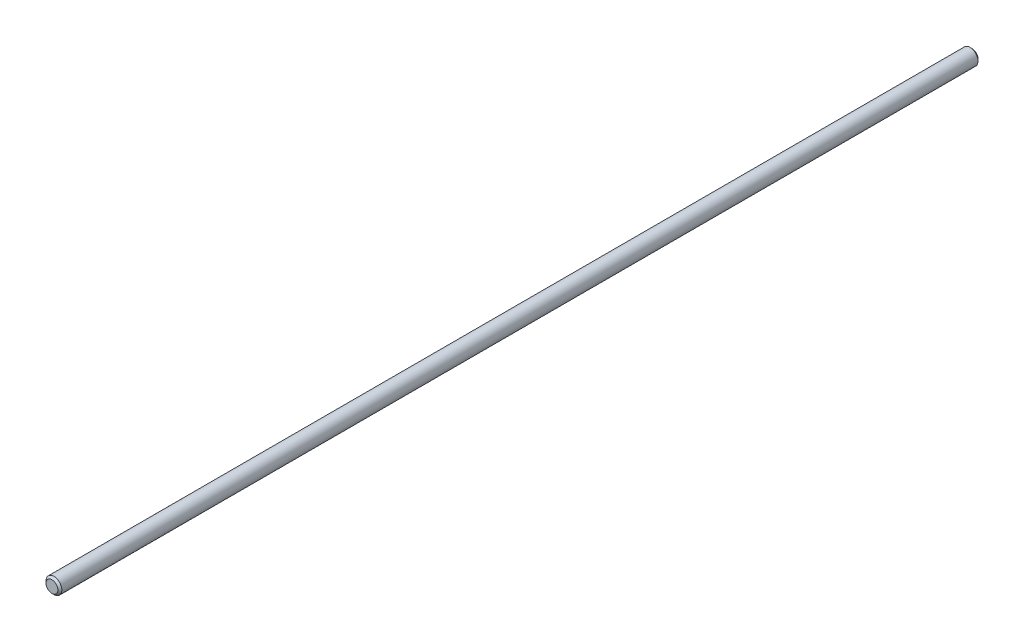
ISO-10303-21;
HEADER;
FILE_DESCRIPTION(('STEP AP214'),'2;1');
FILE_NAME('part.step','',(''),(''),'','','');
FILE_SCHEMA(('AUTOMOTIVE_DESIGN { 1 0 10303 214 1 1 1 1 }'));
ENDSEC;
DATA;
#1=APPLICATION_CONTEXT('core data for automotive mechanical design processes');
#2=APPLICATION_PROTOCOL_DEFINITION('international standard','automotive_design',2000,#1);
#3=PRODUCT_CONTEXT('',#1,'mechanical');
#4=PRODUCT('Part','Part','',(#3));
#5=PRODUCT_RELATED_PRODUCT_CATEGORY('part','',(#4));
#6=PRODUCT_DEFINITION_FORMATION('','',#4);
#7=PRODUCT_DEFINITION_CONTEXT('part definition',#1,'design');
#8=PRODUCT_DEFINITION('design','',#6,#7);
#9=PRODUCT_DEFINITION_SHAPE('','',#8);
#10=(LENGTH_UNIT() NAMED_UNIT(*) SI_UNIT(.MILLI.,.METRE.));
#11=(NAMED_UNIT(*) PLANE_ANGLE_UNIT() SI_UNIT($,.RADIAN.));
#12=(NAMED_UNIT(*) SI_UNIT($,.STERADIAN.) SOLID_ANGLE_UNIT());
#13=UNCERTAINTY_MEASURE_WITH_UNIT(LENGTH_MEASURE(1.E-05),#10,'distance_accuracy_value','');
#14=(GEOMETRIC_REPRESENTATION_CONTEXT(3) GLOBAL_UNCERTAINTY_ASSIGNED_CONTEXT((#13)) GLOBAL_UNIT_ASSIGNED_CONTEXT((#10,
#11,#12)) REPRESENTATION_CONTEXT('',''));
#15=CARTESIAN_POINT('',(0.,0.,0.));
#16=DIRECTION('',(0.,0.,1.));
#17=DIRECTION('',(1.,0.,0.));
#18=AXIS2_PLACEMENT_3D('',#15,#16,#17);
#19=CARTESIAN_POINT('',(0.,0.,465.));
#20=DIRECTION('',(0.,0.,-1.));
#21=DIRECTION('',(-1.,0.,0.));
#22=AXIS2_PLACEMENT_3D('',#19,#20,#21);
#23=CYLINDRICAL_SURFACE('',#22,4.);
#24=CARTESIAN_POINT('',(0.,0.,1.00000000000011));
#25=DIRECTION('',(0.,0.,1.));
#26=DIRECTION('',(1.,0.,0.));
#27=AXIS2_PLACEMENT_3D('',#24,#25,#26);
#28=CIRCLE('',#27,4.);
#29=CARTESIAN_POINT('',(4.,0.,1.00000000000011));
#30=VERTEX_POINT('',#29);
#31=EDGE_CURVE('E46',#30,#30,#28,.T.);
#32=ORIENTED_EDGE('',*,*,#31,.T.);
#33=EDGE_LOOP('',(#32));
#34=FACE_BOUND('',#33,.T.);
#35=CARTESIAN_POINT('',(0.,0.,464.));
#36=DIRECTION('',(0.,0.,1.));
#37=DIRECTION('',(1.,0.,0.));
#38=AXIS2_PLACEMENT_3D('',#35,#36,#37);
#39=CIRCLE('',#38,4.);
#40=CARTESIAN_POINT('',(4.,0.,464.));
#41=VERTEX_POINT('',#40);
#42=EDGE_CURVE('E50',#41,#41,#39,.F.);
#43=ORIENTED_EDGE('',*,*,#42,.T.);
#44=EDGE_LOOP('',(#43));
#45=FACE_BOUND('',#44,.T.);
#46=ADVANCED_FACE('F35',(#34,#45),#23,.T.);
#47=CARTESIAN_POINT('',(0.,0.,465.));
#48=DIRECTION('',(0.,0.,1.));
#49=DIRECTION('',(1.,0.,0.));
#50=AXIS2_PLACEMENT_3D('',#47,#48,#49);
#51=PLANE('',#50);
#52=CARTESIAN_POINT('',(0.,0.,465.));
#53=DIRECTION('',(0.,0.,1.));
#54=DIRECTION('',(1.,0.,0.));
#55=AXIS2_PLACEMENT_3D('',#52,#53,#54);
#56=CIRCLE('',#55,2.99999999999995);
#57=CARTESIAN_POINT('',(2.99999999999995,0.,465.));
#58=VERTEX_POINT('',#57);
#59=EDGE_CURVE('E10',#58,#58,#56,.T.);
#60=ORIENTED_EDGE('',*,*,#59,.T.);
#61=EDGE_LOOP('',(#60));
#62=FACE_BOUND('',#61,.T.);
#63=ADVANCED_FACE('F66',(#62),#51,.T.);
#64=CARTESIAN_POINT('',(0.,0.,0.));
#65=DIRECTION('',(0.,0.,1.));
#66=DIRECTION('',(1.,0.,0.));
#67=AXIS2_PLACEMENT_3D('',#64,#65,#66);
#68=PLANE('',#67);
#69=CARTESIAN_POINT('',(0.,0.,0.));
#70=DIRECTION('',(0.,0.,1.));
#71=DIRECTION('',(1.,0.,0.));
#72=AXIS2_PLACEMENT_3D('',#69,#70,#71);
#73=CIRCLE('',#72,2.99999999999995);
#74=CARTESIAN_POINT('',(2.99999999999995,0.,0.));
#75=VERTEX_POINT('',#74);
#76=EDGE_CURVE('E42',#75,#75,#73,.F.);
#77=ORIENTED_EDGE('',*,*,#76,.T.);
#78=EDGE_LOOP('',(#77));
#79=FACE_BOUND('',#78,.T.);
#80=ADVANCED_FACE('F63',(#79),#68,.F.);
#81=CARTESIAN_POINT('',(0.,0.,1.00000000000011));
#82=DIRECTION('',(0.,0.,1.));
#83=DIRECTION('',(1.,0.,0.));
#84=AXIS2_PLACEMENT_3D('',#81,#82,#83);
#85=CONICAL_SURFACE('',#84,4.,0.785398163397419);
#86=ORIENTED_EDGE('',*,*,#76,.F.);
#87=EDGE_LOOP('',(#86));
#88=FACE_BOUND('',#87,.T.);
#89=ORIENTED_EDGE('',*,*,#31,.F.);
#90=EDGE_LOOP('',(#89));
#91=FACE_BOUND('',#90,.T.);
#92=ADVANCED_FACE('F59',(#88,#91),#85,.T.);
#93=CARTESIAN_POINT('',(0.,0.,465.));
#94=DIRECTION('',(0.,0.,-1.));
#95=DIRECTION('',(-1.,0.,0.));
#96=AXIS2_PLACEMENT_3D('',#93,#94,#95);
#97=CONICAL_SURFACE('',#96,2.99999999999995,0.785398163397447);
#98=ORIENTED_EDGE('',*,*,#42,.F.);
#99=EDGE_LOOP('',(#98));
#100=FACE_BOUND('',#99,.T.);
#101=ORIENTED_EDGE('',*,*,#59,.F.);
#102=EDGE_LOOP('',(#101));
#103=FACE_BOUND('',#102,.T.);
#104=ADVANCED_FACE('F37',(#100,#103),#97,.T.);
#105=CLOSED_SHELL('',(#46,#63,#80,#92,#104));
#106=MANIFOLD_SOLID_BREP('B2',#105);
#107=ADVANCED_BREP_SHAPE_REPRESENTATION('',(#18,#106),#14);
#108=SHAPE_DEFINITION_REPRESENTATION(#9,#107);
ENDSEC;
END-ISO-10303-21;
